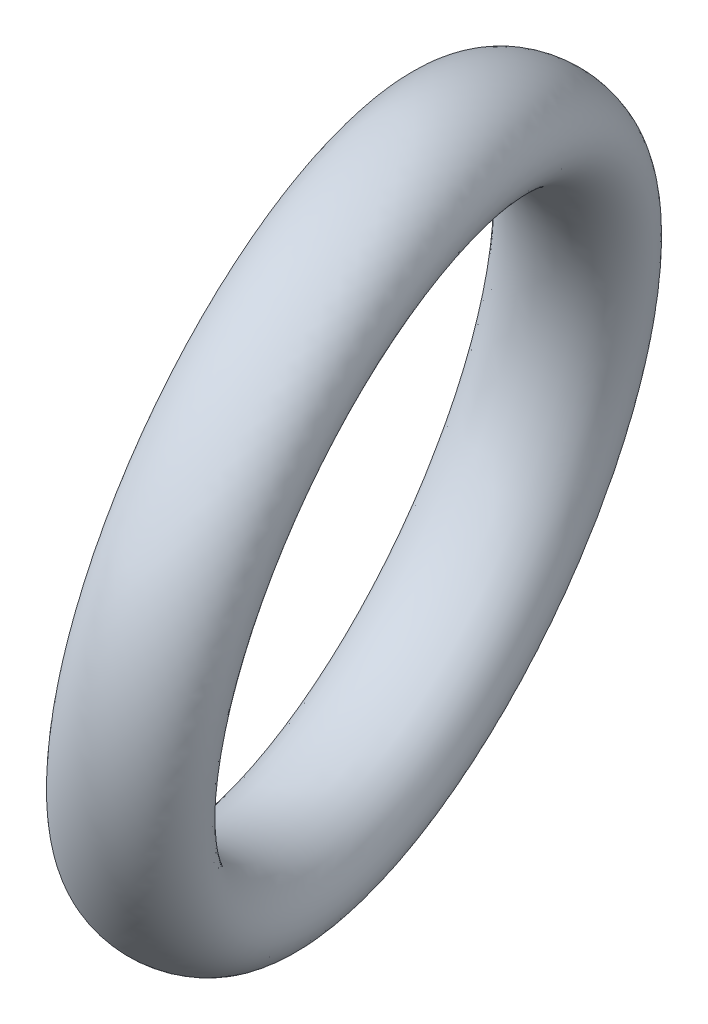
ISO-10303-21;
HEADER;
FILE_DESCRIPTION(('STEP AP214'),'2;1');
FILE_NAME('part.step','',(''),(''),'','','');
FILE_SCHEMA(('AUTOMOTIVE_DESIGN { 1 0 10303 214 1 1 1 1 }'));
ENDSEC;
DATA;
#1=APPLICATION_CONTEXT('core data for automotive mechanical design processes');
#2=APPLICATION_PROTOCOL_DEFINITION('international standard','automotive_design',2000,#1);
#3=PRODUCT_CONTEXT('',#1,'mechanical');
#4=PRODUCT('Part','Part','',(#3));
#5=PRODUCT_RELATED_PRODUCT_CATEGORY('part','',(#4));
#6=PRODUCT_DEFINITION_FORMATION('','',#4);
#7=PRODUCT_DEFINITION_CONTEXT('part definition',#1,'design');
#8=PRODUCT_DEFINITION('design','',#6,#7);
#9=PRODUCT_DEFINITION_SHAPE('','',#8);
#10=(LENGTH_UNIT() NAMED_UNIT(*) SI_UNIT(.MILLI.,.METRE.));
#11=(NAMED_UNIT(*) PLANE_ANGLE_UNIT() SI_UNIT($,.RADIAN.));
#12=(NAMED_UNIT(*) SI_UNIT($,.STERADIAN.) SOLID_ANGLE_UNIT());
#13=UNCERTAINTY_MEASURE_WITH_UNIT(LENGTH_MEASURE(1.E-05),#10,'distance_accuracy_value','');
#14=(GEOMETRIC_REPRESENTATION_CONTEXT(3) GLOBAL_UNCERTAINTY_ASSIGNED_CONTEXT((#13)) GLOBAL_UNIT_ASSIGNED_CONTEXT((#10,
#11,#12)) REPRESENTATION_CONTEXT('',''));
#15=CARTESIAN_POINT('',(0.,0.,0.));
#16=DIRECTION('',(0.,0.,1.));
#17=DIRECTION('',(1.,0.,0.));
#18=AXIS2_PLACEMENT_3D('',#15,#16,#17);
#19=CARTESIAN_POINT('',(-42.7635002930393,150.533892427828,-246.506339118482));
#20=DIRECTION('',(0.,-0.866025403784438,0.500000000000001));
#21=DIRECTION('',(0.95531900312793,-0.147788364107817,-0.255976955402227));
#22=AXIS2_PLACEMENT_3D('',#19,#20,#21);
#23=ELLIPSE('',#22,47.5,35.);
#24=CARTESIAN_POINT('',(24.7831715224387,259.691030022734,-57.4406307953193));
#25=DIRECTION('',(0.95531900312793,-0.147788364107817,-0.255976955402227));
#26=AXIS1_PLACEMENT('',#24,#25);
#27=SURFACE_OF_REVOLUTION('',#23,#26);
#28=ADVANCED_FACE('F34',(),#27,.T.);
#29=CLOSED_SHELL('',(#28));
#30=MANIFOLD_SOLID_BREP('B2',#29);
#31=ADVANCED_BREP_SHAPE_REPRESENTATION('',(#18,#30),#14);
#32=SHAPE_DEFINITION_REPRESENTATION(#9,#31);
ENDSEC;
END-ISO-10303-21;
